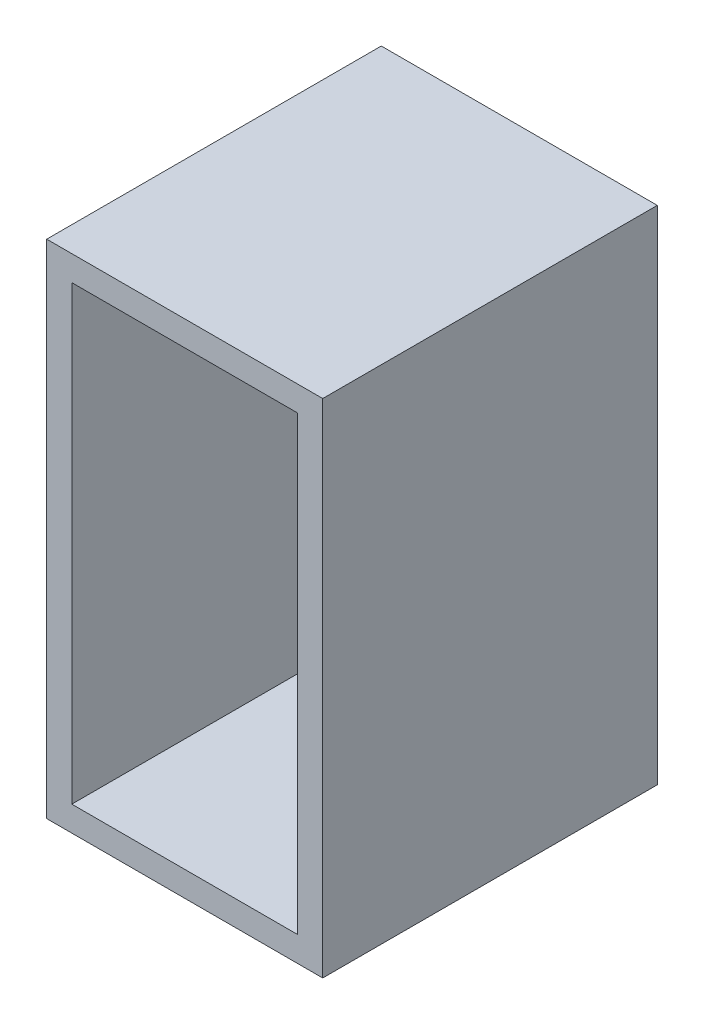
ISO-10303-21;
HEADER;
FILE_DESCRIPTION(('STEP AP214'),'2;1');
FILE_NAME('part.step','',(''),(''),'','','');
FILE_SCHEMA(('AUTOMOTIVE_DESIGN { 1 0 10303 214 1 1 1 1 }'));
ENDSEC;
DATA;
#1=APPLICATION_CONTEXT('core data for automotive mechanical design processes');
#2=APPLICATION_PROTOCOL_DEFINITION('international standard','automotive_design',2000,#1);
#3=PRODUCT_CONTEXT('',#1,'mechanical');
#4=PRODUCT('Part','Part','',(#3));
#5=PRODUCT_RELATED_PRODUCT_CATEGORY('part','',(#4));
#6=PRODUCT_DEFINITION_FORMATION('','',#4);
#7=PRODUCT_DEFINITION_CONTEXT('part definition',#1,'design');
#8=PRODUCT_DEFINITION('design','',#6,#7);
#9=PRODUCT_DEFINITION_SHAPE('','',#8);
#10=(LENGTH_UNIT() NAMED_UNIT(*) SI_UNIT(.MILLI.,.METRE.));
#11=(NAMED_UNIT(*) PLANE_ANGLE_UNIT() SI_UNIT($,.RADIAN.));
#12=(NAMED_UNIT(*) SI_UNIT($,.STERADIAN.) SOLID_ANGLE_UNIT());
#13=UNCERTAINTY_MEASURE_WITH_UNIT(LENGTH_MEASURE(1.E-05),#10,'distance_accuracy_value','');
#14=(GEOMETRIC_REPRESENTATION_CONTEXT(3) GLOBAL_UNCERTAINTY_ASSIGNED_CONTEXT((#13)) GLOBAL_UNIT_ASSIGNED_CONTEXT((#10,
#11,#12)) REPRESENTATION_CONTEXT('',''));
#15=CARTESIAN_POINT('',(0.,0.,0.));
#16=DIRECTION('',(0.,0.,1.));
#17=DIRECTION('',(1.,0.,0.));
#18=AXIS2_PLACEMENT_3D('',#15,#16,#17);
#19=CARTESIAN_POINT('',(0.,-3.,1.5));
#20=DIRECTION('',(0.,1.,0.));
#21=DIRECTION('',(0.,0.,1.));
#22=AXIS2_PLACEMENT_3D('',#19,#20,#21);
#23=PLANE('',#22);
#24=DIRECTION('',(1.,0.,0.));
#25=VECTOR('',#24,1.);
#26=CARTESIAN_POINT('',(0.,-3.,0.));
#27=LINE('',#26,#25);
#28=CARTESIAN_POINT('',(3.,-3.,0.));
#29=VERTEX_POINT('',#28);
#30=CARTESIAN_POINT('',(13.5,-3.,0.));
#31=VERTEX_POINT('',#30);
#32=EDGE_CURVE('E110',#29,#31,#27,.T.);
#33=ORIENTED_EDGE('',*,*,#32,.T.);
#34=DIRECTION('',(0.,0.,-1.));
#35=VECTOR('',#34,1.);
#36=CARTESIAN_POINT('',(13.5,-3.,1.5));
#37=LINE('',#36,#35);
#38=CARTESIAN_POINT('',(13.5,-3.,1.5));
#39=VERTEX_POINT('',#38);
#40=EDGE_CURVE('E11',#39,#31,#37,.T.);
#41=ORIENTED_EDGE('',*,*,#40,.F.);
#42=DIRECTION('',(1.,0.,0.));
#43=VECTOR('',#42,1.);
#44=CARTESIAN_POINT('',(0.,-3.,1.5));
#45=LINE('',#44,#43);
#46=CARTESIAN_POINT('',(3.,-3.,1.5));
#47=VERTEX_POINT('',#46);
#48=EDGE_CURVE('E95',#47,#39,#45,.T.);
#49=ORIENTED_EDGE('',*,*,#48,.F.);
#50=DIRECTION('',(0.,0.,-1.));
#51=VECTOR('',#50,1.);
#52=CARTESIAN_POINT('',(3.,-3.,1.5));
#53=LINE('',#52,#51);
#54=EDGE_CURVE('E51',#47,#29,#53,.T.);
#55=ORIENTED_EDGE('',*,*,#54,.T.);
#56=EDGE_LOOP('',(#33,#41,#49,#55));
#57=FACE_BOUND('',#56,.T.);
#58=ADVANCED_FACE('F35',(#57),#23,.F.);
#59=CARTESIAN_POINT('',(13.5,0.,1.5));
#60=DIRECTION('',(1.,0.,0.));
#61=DIRECTION('',(0.,0.,-1.));
#62=AXIS2_PLACEMENT_3D('',#59,#60,#61);
#63=PLANE('',#62);
#64=DIRECTION('',(0.,-1.,0.));
#65=VECTOR('',#64,1.);
#66=CARTESIAN_POINT('',(13.5,0.,0.));
#67=LINE('',#66,#65);
#68=CARTESIAN_POINT('',(13.5,-8.5,0.));
#69=VERTEX_POINT('',#68);
#70=EDGE_CURVE('E101',#31,#69,#67,.T.);
#71=ORIENTED_EDGE('',*,*,#70,.T.);
#72=DIRECTION('',(0.,0.,-1.));
#73=VECTOR('',#72,1.);
#74=CARTESIAN_POINT('',(13.5,-8.5,1.5));
#75=LINE('',#74,#73);
#76=CARTESIAN_POINT('',(13.5,-8.5,1.5));
#77=VERTEX_POINT('',#76);
#78=EDGE_CURVE('E43',#77,#69,#75,.T.);
#79=ORIENTED_EDGE('',*,*,#78,.F.);
#80=DIRECTION('',(0.,-1.,0.));
#81=VECTOR('',#80,1.);
#82=CARTESIAN_POINT('',(13.5,0.,1.5));
#83=LINE('',#82,#81);
#84=EDGE_CURVE('E89',#39,#77,#83,.T.);
#85=ORIENTED_EDGE('',*,*,#84,.F.);
#86=ORIENTED_EDGE('',*,*,#40,.T.);
#87=EDGE_LOOP('',(#71,#79,#85,#86));
#88=FACE_BOUND('',#87,.T.);
#89=ADVANCED_FACE('F100',(#88),#63,.F.);
#90=CARTESIAN_POINT('',(0.,-8.5,1.5));
#91=DIRECTION('',(0.,1.,0.));
#92=DIRECTION('',(0.,0.,1.));
#93=AXIS2_PLACEMENT_3D('',#90,#91,#92);
#94=PLANE('',#93);
#95=DIRECTION('',(1.,0.,0.));
#96=VECTOR('',#95,1.);
#97=CARTESIAN_POINT('',(0.,-8.5,0.));
#98=LINE('',#97,#96);
#99=CARTESIAN_POINT('',(3.,-8.5,0.));
#100=VERTEX_POINT('',#99);
#101=EDGE_CURVE('E114',#100,#69,#98,.T.);
#102=ORIENTED_EDGE('',*,*,#101,.F.);
#103=DIRECTION('',(0.,0.,-1.));
#104=VECTOR('',#103,1.);
#105=CARTESIAN_POINT('',(3.,-8.5,1.5));
#106=LINE('',#105,#104);
#107=CARTESIAN_POINT('',(3.,-8.5,1.5));
#108=VERTEX_POINT('',#107);
#109=EDGE_CURVE('E66',#108,#100,#106,.T.);
#110=ORIENTED_EDGE('',*,*,#109,.F.);
#111=DIRECTION('',(1.,0.,0.));
#112=VECTOR('',#111,1.);
#113=CARTESIAN_POINT('',(0.,-8.5,1.5));
#114=LINE('',#113,#112);
#115=EDGE_CURVE('E94',#108,#77,#114,.T.);
#116=ORIENTED_EDGE('',*,*,#115,.T.);
#117=ORIENTED_EDGE('',*,*,#78,.T.);
#118=EDGE_LOOP('',(#102,#110,#116,#117));
#119=FACE_BOUND('',#118,.T.);
#120=ADVANCED_FACE('F104',(#119),#94,.T.);
#121=CARTESIAN_POINT('',(3.,0.,1.5));
#122=DIRECTION('',(1.,0.,0.));
#123=DIRECTION('',(0.,1.,0.));
#124=AXIS2_PLACEMENT_3D('',#121,#122,#123);
#125=PLANE('',#124);
#126=DIRECTION('',(0.,-1.,0.));
#127=VECTOR('',#126,1.);
#128=CARTESIAN_POINT('',(3.,0.,0.));
#129=LINE('',#128,#127);
#130=EDGE_CURVE('E116',#29,#100,#129,.T.);
#131=ORIENTED_EDGE('',*,*,#130,.F.);
#132=ORIENTED_EDGE('',*,*,#54,.F.);
#133=DIRECTION('',(0.,-1.,0.));
#134=VECTOR('',#133,1.);
#135=CARTESIAN_POINT('',(3.,0.,1.5));
#136=LINE('',#135,#134);
#137=EDGE_CURVE('E105',#47,#108,#136,.T.);
#138=ORIENTED_EDGE('',*,*,#137,.T.);
#139=ORIENTED_EDGE('',*,*,#109,.T.);
#140=EDGE_LOOP('',(#131,#132,#138,#139));
#141=FACE_BOUND('',#140,.T.);
#142=ADVANCED_FACE('F267',(#141),#125,.T.);
#143=CARTESIAN_POINT('',(0.,0.,1.5));
#144=DIRECTION('',(0.,0.,1.));
#145=DIRECTION('',(1.,0.,0.));
#146=AXIS2_PLACEMENT_3D('',#143,#144,#145);
#147=PLANE('',#146);
#148=DIRECTION('',(0.,-1.,0.));
#149=VECTOR('',#148,1.);
#150=CARTESIAN_POINT('',(15.,0.,1.5));
#151=LINE('',#150,#149);
#152=CARTESIAN_POINT('',(15.,-1.5,1.5));
#153=VERTEX_POINT('',#152);
#154=CARTESIAN_POINT('',(15.,-28.5,1.5));
#155=VERTEX_POINT('',#154);
#156=EDGE_CURVE('E119',#153,#155,#151,.T.);
#157=ORIENTED_EDGE('',*,*,#156,.F.);
#158=DIRECTION('',(1.,0.,0.));
#159=VECTOR('',#158,1.);
#160=CARTESIAN_POINT('',(0.,-1.5,1.5));
#161=LINE('',#160,#159);
#162=CARTESIAN_POINT('',(1.5,-1.5,1.5));
#163=VERTEX_POINT('',#162);
#164=EDGE_CURVE('E123',#163,#153,#161,.T.);
#165=ORIENTED_EDGE('',*,*,#164,.F.);
#166=DIRECTION('',(0.,-1.,0.));
#167=VECTOR('',#166,1.);
#168=CARTESIAN_POINT('',(1.5,0.,1.5));
#169=LINE('',#168,#167);
#170=CARTESIAN_POINT('',(1.5,-28.5,1.5));
#171=VERTEX_POINT('',#170);
#172=EDGE_CURVE('E132',#163,#171,#169,.T.);
#173=ORIENTED_EDGE('',*,*,#172,.T.);
#174=DIRECTION('',(1.,0.,0.));
#175=VECTOR('',#174,1.);
#176=CARTESIAN_POINT('',(0.,-28.5,1.5));
#177=LINE('',#176,#175);
#178=EDGE_CURVE('E140',#171,#155,#177,.T.);
#179=ORIENTED_EDGE('',*,*,#178,.T.);
#180=EDGE_LOOP('',(#157,#165,#173,#179));
#181=FACE_BOUND('',#180,.T.);
#182=ORIENTED_EDGE('',*,*,#48,.T.);
#183=ORIENTED_EDGE('',*,*,#84,.T.);
#184=ORIENTED_EDGE('',*,*,#115,.F.);
#185=ORIENTED_EDGE('',*,*,#137,.F.);
#186=EDGE_LOOP('',(#182,#183,#184,#185));
#187=FACE_BOUND('',#186,.T.);
#188=ADVANCED_FACE('F91',(#181,#187),#147,.T.);
#189=CARTESIAN_POINT('',(0.,0.,0.));
#190=DIRECTION('',(0.,0.,1.));
#191=DIRECTION('',(1.,0.,0.));
#192=AXIS2_PLACEMENT_3D('',#189,#190,#191);
#193=PLANE('',#192);
#194=ORIENTED_EDGE('',*,*,#32,.F.);
#195=ORIENTED_EDGE('',*,*,#130,.T.);
#196=ORIENTED_EDGE('',*,*,#101,.T.);
#197=ORIENTED_EDGE('',*,*,#70,.F.);
#198=EDGE_LOOP('',(#194,#195,#196,#197));
#199=FACE_BOUND('',#198,.T.);
#200=DIRECTION('',(0.,-1.,0.));
#201=VECTOR('',#200,1.);
#202=CARTESIAN_POINT('',(16.5,0.,0.));
#203=LINE('',#202,#201);
#204=CARTESIAN_POINT('',(16.5,0.,0.));
#205=VERTEX_POINT('',#204);
#206=CARTESIAN_POINT('',(16.5,-30.,0.));
#207=VERTEX_POINT('',#206);
#208=EDGE_CURVE('E195',#205,#207,#203,.T.);
#209=ORIENTED_EDGE('',*,*,#208,.T.);
#210=DIRECTION('',(1.,0.,0.));
#211=VECTOR('',#210,1.);
#212=CARTESIAN_POINT('',(0.,-30.,0.));
#213=LINE('',#212,#211);
#214=CARTESIAN_POINT('',(0.,-30.,0.));
#215=VERTEX_POINT('',#214);
#216=EDGE_CURVE('E186',#215,#207,#213,.T.);
#217=ORIENTED_EDGE('',*,*,#216,.F.);
#218=DIRECTION('',(0.,-1.,0.));
#219=VECTOR('',#218,1.);
#220=CARTESIAN_POINT('',(0.,0.,0.));
#221=LINE('',#220,#219);
#222=CARTESIAN_POINT('',(0.,0.,0.));
#223=VERTEX_POINT('',#222);
#224=EDGE_CURVE('E190',#223,#215,#221,.T.);
#225=ORIENTED_EDGE('',*,*,#224,.F.);
#226=DIRECTION('',(1.,0.,0.));
#227=VECTOR('',#226,1.);
#228=CARTESIAN_POINT('',(0.,0.,0.));
#229=LINE('',#228,#227);
#230=EDGE_CURVE('E192',#223,#205,#229,.T.);
#231=ORIENTED_EDGE('',*,*,#230,.T.);
#232=EDGE_LOOP('',(#209,#217,#225,#231));
#233=FACE_BOUND('',#232,.T.);
#234=ADVANCED_FACE('F260',(#199,#233),#193,.F.);
#235=CARTESIAN_POINT('',(0.,-1.5,20.));
#236=DIRECTION('',(0.,1.,0.));
#237=DIRECTION('',(0.,0.,1.));
#238=AXIS2_PLACEMENT_3D('',#235,#236,#237);
#239=PLANE('',#238);
#240=ORIENTED_EDGE('',*,*,#164,.T.);
#241=DIRECTION('',(0.,0.,-1.));
#242=VECTOR('',#241,1.);
#243=CARTESIAN_POINT('',(15.,-1.5,20.));
#244=LINE('',#243,#242);
#245=CARTESIAN_POINT('',(15.,-1.5,20.));
#246=VERTEX_POINT('',#245);
#247=EDGE_CURVE('E112',#246,#153,#244,.T.);
#248=ORIENTED_EDGE('',*,*,#247,.F.);
#249=DIRECTION('',(1.,0.,0.));
#250=VECTOR('',#249,1.);
#251=CARTESIAN_POINT('',(0.,-1.5,20.));
#252=LINE('',#251,#250);
#253=CARTESIAN_POINT('',(1.5,-1.5,20.));
#254=VERTEX_POINT('',#253);
#255=EDGE_CURVE('E203',#254,#246,#252,.T.);
#256=ORIENTED_EDGE('',*,*,#255,.F.);
#257=DIRECTION('',(0.,0.,-1.));
#258=VECTOR('',#257,1.);
#259=CARTESIAN_POINT('',(1.5,-1.5,20.));
#260=LINE('',#259,#258);
#261=EDGE_CURVE('E156',#254,#163,#260,.T.);
#262=ORIENTED_EDGE('',*,*,#261,.T.);
#263=EDGE_LOOP('',(#240,#248,#256,#262));
#264=FACE_BOUND('',#263,.T.);
#265=ADVANCED_FACE('F251',(#264),#239,.F.);
#266=CARTESIAN_POINT('',(15.,0.,20.));
#267=DIRECTION('',(1.,0.,0.));
#268=DIRECTION('',(0.,1.,0.));
#269=AXIS2_PLACEMENT_3D('',#266,#267,#268);
#270=PLANE('',#269);
#271=ORIENTED_EDGE('',*,*,#156,.T.);
#272=DIRECTION('',(0.,0.,-1.));
#273=VECTOR('',#272,1.);
#274=CARTESIAN_POINT('',(15.,-28.5,20.));
#275=LINE('',#274,#273);
#276=CARTESIAN_POINT('',(15.,-28.5,20.));
#277=VERTEX_POINT('',#276);
#278=EDGE_CURVE('E150',#277,#155,#275,.T.);
#279=ORIENTED_EDGE('',*,*,#278,.F.);
#280=DIRECTION('',(0.,-1.,0.));
#281=VECTOR('',#280,1.);
#282=CARTESIAN_POINT('',(15.,0.,20.));
#283=LINE('',#282,#281);
#284=EDGE_CURVE('E200',#246,#277,#283,.T.);
#285=ORIENTED_EDGE('',*,*,#284,.F.);
#286=ORIENTED_EDGE('',*,*,#247,.T.);
#287=EDGE_LOOP('',(#271,#279,#285,#286));
#288=FACE_BOUND('',#287,.T.);
#289=ADVANCED_FACE('F252',(#288),#270,.F.);
#290=CARTESIAN_POINT('',(0.,-28.5,20.));
#291=DIRECTION('',(0.,1.,0.));
#292=DIRECTION('',(0.,0.,1.));
#293=AXIS2_PLACEMENT_3D('',#290,#291,#292);
#294=PLANE('',#293);
#295=ORIENTED_EDGE('',*,*,#278,.T.);
#296=ORIENTED_EDGE('',*,*,#178,.F.);
#297=DIRECTION('',(0.,0.,-1.));
#298=VECTOR('',#297,1.);
#299=CARTESIAN_POINT('',(1.5,-28.5,20.));
#300=LINE('',#299,#298);
#301=CARTESIAN_POINT('',(1.5,-28.5,20.));
#302=VERTEX_POINT('',#301);
#303=EDGE_CURVE('E79',#302,#171,#300,.T.);
#304=ORIENTED_EDGE('',*,*,#303,.F.);
#305=DIRECTION('',(1.,0.,0.));
#306=VECTOR('',#305,1.);
#307=CARTESIAN_POINT('',(0.,-28.5,20.));
#308=LINE('',#307,#306);
#309=EDGE_CURVE('E152',#302,#277,#308,.T.);
#310=ORIENTED_EDGE('',*,*,#309,.T.);
#311=EDGE_LOOP('',(#295,#296,#304,#310));
#312=FACE_BOUND('',#311,.T.);
#313=ADVANCED_FACE('F146',(#312),#294,.T.);
#314=CARTESIAN_POINT('',(16.5,0.,20.));
#315=DIRECTION('',(1.,0.,0.));
#316=DIRECTION('',(0.,1.,0.));
#317=AXIS2_PLACEMENT_3D('',#314,#315,#316);
#318=PLANE('',#317);
#319=ORIENTED_EDGE('',*,*,#208,.F.);
#320=DIRECTION('',(0.,0.,-1.));
#321=VECTOR('',#320,1.);
#322=CARTESIAN_POINT('',(16.5,0.,20.));
#323=LINE('',#322,#321);
#324=CARTESIAN_POINT('',(16.5,0.,20.));
#325=VERTEX_POINT('',#324);
#326=EDGE_CURVE('E135',#325,#205,#323,.T.);
#327=ORIENTED_EDGE('',*,*,#326,.F.);
#328=DIRECTION('',(0.,-1.,0.));
#329=VECTOR('',#328,1.);
#330=CARTESIAN_POINT('',(16.5,0.,20.));
#331=LINE('',#330,#329);
#332=CARTESIAN_POINT('',(16.5,-30.,20.));
#333=VERTEX_POINT('',#332);
#334=EDGE_CURVE('E189',#325,#333,#331,.T.);
#335=ORIENTED_EDGE('',*,*,#334,.T.);
#336=DIRECTION('',(0.,0.,-1.));
#337=VECTOR('',#336,1.);
#338=CARTESIAN_POINT('',(16.5,-30.,20.));
#339=LINE('',#338,#337);
#340=EDGE_CURVE('E160',#333,#207,#339,.T.);
#341=ORIENTED_EDGE('',*,*,#340,.T.);
#342=EDGE_LOOP('',(#319,#327,#335,#341));
#343=FACE_BOUND('',#342,.T.);
#344=ADVANCED_FACE('F218',(#343),#318,.T.);
#345=CARTESIAN_POINT('',(0.,0.,20.));
#346=DIRECTION('',(0.,1.,0.));
#347=DIRECTION('',(0.,0.,1.));
#348=AXIS2_PLACEMENT_3D('',#345,#346,#347);
#349=PLANE('',#348);
#350=ORIENTED_EDGE('',*,*,#230,.F.);
#351=DIRECTION('',(0.,0.,-1.));
#352=VECTOR('',#351,1.);
#353=CARTESIAN_POINT('',(0.,0.,20.));
#354=LINE('',#353,#352);
#355=CARTESIAN_POINT('',(0.,0.,20.));
#356=VERTEX_POINT('',#355);
#357=EDGE_CURVE('E166',#356,#223,#354,.T.);
#358=ORIENTED_EDGE('',*,*,#357,.F.);
#359=DIRECTION('',(1.,0.,0.));
#360=VECTOR('',#359,1.);
#361=CARTESIAN_POINT('',(0.,0.,20.));
#362=LINE('',#361,#360);
#363=EDGE_CURVE('E212',#356,#325,#362,.T.);
#364=ORIENTED_EDGE('',*,*,#363,.T.);
#365=ORIENTED_EDGE('',*,*,#326,.T.);
#366=EDGE_LOOP('',(#350,#358,#364,#365));
#367=FACE_BOUND('',#366,.T.);
#368=ADVANCED_FACE('F232',(#367),#349,.T.);
#369=CARTESIAN_POINT('',(0.,0.,20.));
#370=DIRECTION('',(1.,0.,0.));
#371=DIRECTION('',(0.,1.,0.));
#372=AXIS2_PLACEMENT_3D('',#369,#370,#371);
#373=PLANE('',#372);
#374=ORIENTED_EDGE('',*,*,#224,.T.);
#375=DIRECTION('',(0.,0.,-1.));
#376=VECTOR('',#375,1.);
#377=CARTESIAN_POINT('',(0.,-30.,20.));
#378=LINE('',#377,#376);
#379=CARTESIAN_POINT('',(0.,-30.,20.));
#380=VERTEX_POINT('',#379);
#381=EDGE_CURVE('E163',#380,#215,#378,.T.);
#382=ORIENTED_EDGE('',*,*,#381,.F.);
#383=DIRECTION('',(0.,-1.,0.));
#384=VECTOR('',#383,1.);
#385=CARTESIAN_POINT('',(0.,0.,20.));
#386=LINE('',#385,#384);
#387=EDGE_CURVE('E209',#356,#380,#386,.T.);
#388=ORIENTED_EDGE('',*,*,#387,.F.);
#389=ORIENTED_EDGE('',*,*,#357,.T.);
#390=EDGE_LOOP('',(#374,#382,#388,#389));
#391=FACE_BOUND('',#390,.T.);
#392=ADVANCED_FACE('F235',(#391),#373,.F.);
#393=CARTESIAN_POINT('',(0.,-30.,20.));
#394=DIRECTION('',(0.,1.,0.));
#395=DIRECTION('',(0.,0.,1.));
#396=AXIS2_PLACEMENT_3D('',#393,#394,#395);
#397=PLANE('',#396);
#398=ORIENTED_EDGE('',*,*,#216,.T.);
#399=ORIENTED_EDGE('',*,*,#340,.F.);
#400=DIRECTION('',(1.,0.,0.));
#401=VECTOR('',#400,1.);
#402=CARTESIAN_POINT('',(0.,-30.,20.));
#403=LINE('',#402,#401);
#404=EDGE_CURVE('E206',#380,#333,#403,.T.);
#405=ORIENTED_EDGE('',*,*,#404,.F.);
#406=ORIENTED_EDGE('',*,*,#381,.T.);
#407=EDGE_LOOP('',(#398,#399,#405,#406));
#408=FACE_BOUND('',#407,.T.);
#409=ADVANCED_FACE('F285',(#408),#397,.F.);
#410=CARTESIAN_POINT('',(1.5,0.,20.));
#411=DIRECTION('',(1.,0.,0.));
#412=DIRECTION('',(0.,1.,0.));
#413=AXIS2_PLACEMENT_3D('',#410,#411,#412);
#414=PLANE('',#413);
#415=ORIENTED_EDGE('',*,*,#303,.T.);
#416=ORIENTED_EDGE('',*,*,#172,.F.);
#417=ORIENTED_EDGE('',*,*,#261,.F.);
#418=DIRECTION('',(0.,-1.,0.));
#419=VECTOR('',#418,1.);
#420=CARTESIAN_POINT('',(1.5,0.,20.));
#421=LINE('',#420,#419);
#422=EDGE_CURVE('E164',#254,#302,#421,.T.);
#423=ORIENTED_EDGE('',*,*,#422,.T.);
#424=EDGE_LOOP('',(#415,#416,#417,#423));
#425=FACE_BOUND('',#424,.T.);
#426=ADVANCED_FACE('F248',(#425),#414,.T.);
#427=CARTESIAN_POINT('',(0.,0.,20.));
#428=DIRECTION('',(0.,0.,1.));
#429=DIRECTION('',(1.,0.,0.));
#430=AXIS2_PLACEMENT_3D('',#427,#428,#429);
#431=PLANE('',#430);
#432=ORIENTED_EDGE('',*,*,#334,.F.);
#433=ORIENTED_EDGE('',*,*,#363,.F.);
#434=ORIENTED_EDGE('',*,*,#387,.T.);
#435=ORIENTED_EDGE('',*,*,#404,.T.);
#436=EDGE_LOOP('',(#432,#433,#434,#435));
#437=FACE_BOUND('',#436,.T.);
#438=ORIENTED_EDGE('',*,*,#255,.T.);
#439=ORIENTED_EDGE('',*,*,#284,.T.);
#440=ORIENTED_EDGE('',*,*,#309,.F.);
#441=ORIENTED_EDGE('',*,*,#422,.F.);
#442=EDGE_LOOP('',(#438,#439,#440,#441));
#443=FACE_BOUND('',#442,.T.);
#444=ADVANCED_FACE('F227',(#437,#443),#431,.T.);
#445=CLOSED_SHELL('',(#58,#89,#120,#142,#188,#234,#265,#289,#313,#344,#368,#392,#409,#426,#444));
#446=MANIFOLD_SOLID_BREP('B2',#445);
#447=ADVANCED_BREP_SHAPE_REPRESENTATION('',(#18,#446),#14);
#448=SHAPE_DEFINITION_REPRESENTATION(#9,#447);
ENDSEC;
END-ISO-10303-21;
